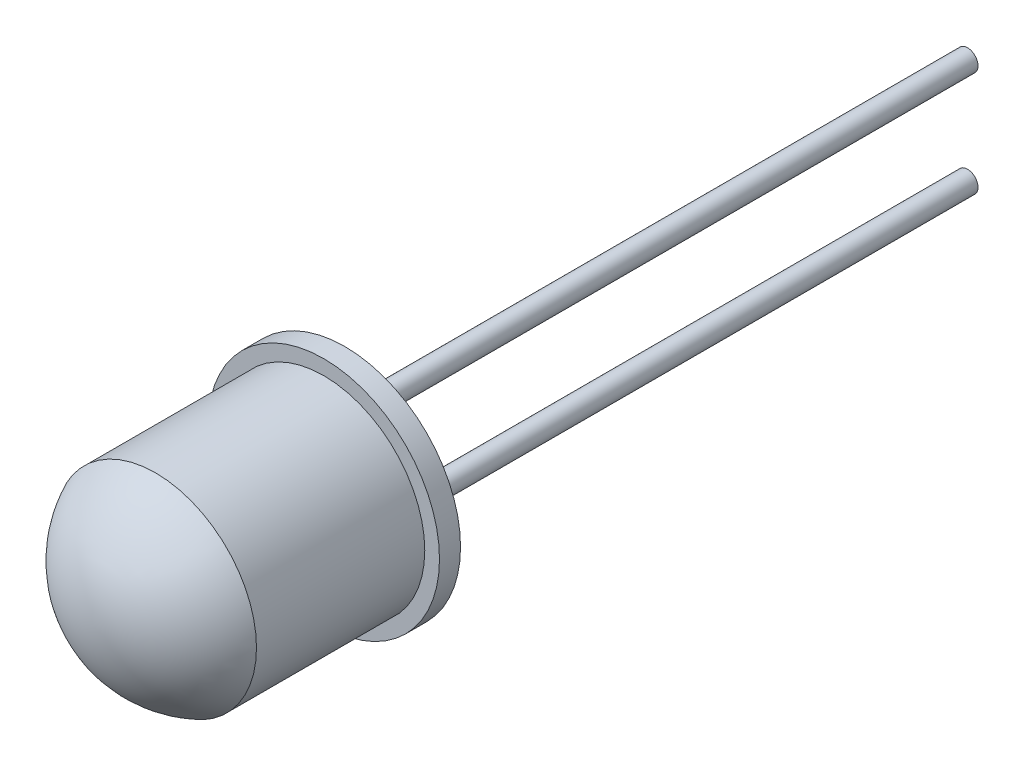
ISO-10303-21;
HEADER;
FILE_DESCRIPTION(('STEP AP214'),'2;1');
FILE_NAME('part.step','',(''),(''),'','','');
FILE_SCHEMA(('AUTOMOTIVE_DESIGN { 1 0 10303 214 1 1 1 1 }'));
ENDSEC;
DATA;
#1=APPLICATION_CONTEXT('core data for automotive mechanical design processes');
#2=APPLICATION_PROTOCOL_DEFINITION('international standard','automotive_design',2000,#1);
#3=PRODUCT_CONTEXT('',#1,'mechanical');
#4=PRODUCT('Part','Part','',(#3));
#5=PRODUCT_RELATED_PRODUCT_CATEGORY('part','',(#4));
#6=PRODUCT_DEFINITION_FORMATION('','',#4);
#7=PRODUCT_DEFINITION_CONTEXT('part definition',#1,'design');
#8=PRODUCT_DEFINITION('design','',#6,#7);
#9=PRODUCT_DEFINITION_SHAPE('','',#8);
#10=(LENGTH_UNIT() NAMED_UNIT(*) SI_UNIT(.MILLI.,.METRE.));
#11=(NAMED_UNIT(*) PLANE_ANGLE_UNIT() SI_UNIT($,.RADIAN.));
#12=(NAMED_UNIT(*) SI_UNIT($,.STERADIAN.) SOLID_ANGLE_UNIT());
#13=UNCERTAINTY_MEASURE_WITH_UNIT(LENGTH_MEASURE(1.E-05),#10,'distance_accuracy_value','');
#14=(GEOMETRIC_REPRESENTATION_CONTEXT(3) GLOBAL_UNCERTAINTY_ASSIGNED_CONTEXT((#13)) GLOBAL_UNIT_ASSIGNED_CONTEXT((#10,
#11,#12)) REPRESENTATION_CONTEXT('',''));
#15=CARTESIAN_POINT('',(0.,0.,0.));
#16=DIRECTION('',(0.,0.,1.));
#17=DIRECTION('',(1.,0.,0.));
#18=AXIS2_PLACEMENT_3D('',#15,#16,#17);
#19=CARTESIAN_POINT('',(0.,0.,0.2));
#20=DIRECTION('',(0.,0.,-1.));
#21=DIRECTION('',(-1.,0.,0.));
#22=AXIS2_PLACEMENT_3D('',#19,#20,#21);
#23=PLANE('',#22);
#24=CARTESIAN_POINT('',(-1.25,0.,0.2));
#25=DIRECTION('',(0.,0.,-1.));
#26=DIRECTION('',(-1.,0.,0.));
#27=AXIS2_PLACEMENT_3D('',#24,#25,#26);
#28=CIRCLE('',#27,0.25);
#29=CARTESIAN_POINT('',(-1.5,0.,0.2));
#30=VERTEX_POINT('',#29);
#31=EDGE_CURVE('E63',#30,#30,#28,.T.);
#32=ORIENTED_EDGE('',*,*,#31,.F.);
#33=EDGE_LOOP('',(#32));
#34=FACE_BOUND('',#33,.T.);
#35=CARTESIAN_POINT('',(0.,0.,0.2));
#36=DIRECTION('',(0.,0.,-1.));
#37=DIRECTION('',(-1.,0.,0.));
#38=AXIS2_PLACEMENT_3D('',#35,#36,#37);
#39=CIRCLE('',#38,2.4);
#40=CARTESIAN_POINT('',(-2.4,0.,0.2));
#41=VERTEX_POINT('',#40);
#42=EDGE_CURVE('E50',#41,#41,#39,.T.);
#43=ORIENTED_EDGE('',*,*,#42,.T.);
#44=EDGE_LOOP('',(#43));
#45=FACE_BOUND('',#44,.T.);
#46=CARTESIAN_POINT('',(0.,1.25,0.2));
#47=DIRECTION('',(0.,0.,-1.));
#48=DIRECTION('',(-1.,0.,0.));
#49=AXIS2_PLACEMENT_3D('',#46,#47,#48);
#50=CIRCLE('',#49,0.25);
#51=CARTESIAN_POINT('',(-0.25,1.25,0.2));
#52=VERTEX_POINT('',#51);
#53=EDGE_CURVE('E57',#52,#52,#50,.T.);
#54=ORIENTED_EDGE('',*,*,#53,.F.);
#55=EDGE_LOOP('',(#54));
#56=FACE_BOUND('',#55,.T.);
#57=CARTESIAN_POINT('',(0.,-1.25,0.2));
#58=DIRECTION('',(0.,0.,-1.));
#59=DIRECTION('',(-1.,0.,0.));
#60=AXIS2_PLACEMENT_3D('',#57,#58,#59);
#61=CIRCLE('',#60,0.25);
#62=CARTESIAN_POINT('',(-0.25,-1.25,0.2));
#63=VERTEX_POINT('',#62);
#64=EDGE_CURVE('E69',#63,#63,#61,.T.);
#65=ORIENTED_EDGE('',*,*,#64,.F.);
#66=EDGE_LOOP('',(#65));
#67=FACE_BOUND('',#66,.T.);
#68=ADVANCED_FACE('F33',(#34,#45,#56,#67),#23,.T.);
#69=CARTESIAN_POINT('',(0.,0.,0.5));
#70=DIRECTION('',(0.,0.,1.));
#71=DIRECTION('',(1.,0.,0.));
#72=AXIS2_PLACEMENT_3D('',#69,#70,#71);
#73=PLANE('',#72);
#74=CARTESIAN_POINT('',(0.,0.,0.5));
#75=DIRECTION('',(0.,0.,1.));
#76=DIRECTION('',(1.,0.,0.));
#77=AXIS2_PLACEMENT_3D('',#74,#75,#76);
#78=CIRCLE('',#77,2.75);
#79=CARTESIAN_POINT('',(2.75,0.,0.5));
#80=VERTEX_POINT('',#79);
#81=EDGE_CURVE('E10',#80,#80,#78,.T.);
#82=ORIENTED_EDGE('',*,*,#81,.T.);
#83=EDGE_LOOP('',(#82));
#84=FACE_BOUND('',#83,.T.);
#85=CARTESIAN_POINT('',(0.,0.,0.5));
#86=DIRECTION('',(0.,0.,1.));
#87=DIRECTION('',(1.,0.,0.));
#88=AXIS2_PLACEMENT_3D('',#85,#86,#87);
#89=CIRCLE('',#88,2.4);
#90=CARTESIAN_POINT('',(2.4,0.,0.5));
#91=VERTEX_POINT('',#90);
#92=EDGE_CURVE('E47',#91,#91,#89,.T.);
#93=ORIENTED_EDGE('',*,*,#92,.F.);
#94=EDGE_LOOP('',(#93));
#95=FACE_BOUND('',#94,.T.);
#96=ADVANCED_FACE('F85',(#84,#95),#73,.T.);
#97=CARTESIAN_POINT('',(0.,0.,0.5));
#98=DIRECTION('',(0.,0.,-1.));
#99=DIRECTION('',(-1.,0.,0.));
#100=AXIS2_PLACEMENT_3D('',#97,#98,#99);
#101=CYLINDRICAL_SURFACE('',#100,2.75);
#102=ORIENTED_EDGE('',*,*,#81,.F.);
#103=EDGE_LOOP('',(#102));
#104=FACE_BOUND('',#103,.T.);
#105=CARTESIAN_POINT('',(0.,0.,0.));
#106=DIRECTION('',(0.,0.,1.));
#107=DIRECTION('',(1.,0.,0.));
#108=AXIS2_PLACEMENT_3D('',#105,#106,#107);
#109=CIRCLE('',#108,2.75);
#110=CARTESIAN_POINT('',(2.75,0.,0.));
#111=VERTEX_POINT('',#110);
#112=EDGE_CURVE('E41',#111,#111,#109,.T.);
#113=ORIENTED_EDGE('',*,*,#112,.T.);
#114=EDGE_LOOP('',(#113));
#115=FACE_BOUND('',#114,.T.);
#116=ADVANCED_FACE('F91',(#104,#115),#101,.T.);
#117=CARTESIAN_POINT('',(0.,0.,0.));
#118=DIRECTION('',(0.,0.,1.));
#119=DIRECTION('',(1.,0.,0.));
#120=AXIS2_PLACEMENT_3D('',#117,#118,#119);
#121=PLANE('',#120);
#122=CARTESIAN_POINT('',(0.,0.,0.));
#123=DIRECTION('',(0.,0.,-1.));
#124=DIRECTION('',(-1.,0.,0.));
#125=AXIS2_PLACEMENT_3D('',#122,#123,#124);
#126=CIRCLE('',#125,2.4);
#127=CARTESIAN_POINT('',(-2.4,0.,0.));
#128=VERTEX_POINT('',#127);
#129=EDGE_CURVE('E51',#128,#128,#126,.T.);
#130=ORIENTED_EDGE('',*,*,#129,.F.);
#131=EDGE_LOOP('',(#130));
#132=FACE_BOUND('',#131,.T.);
#133=ORIENTED_EDGE('',*,*,#112,.F.);
#134=EDGE_LOOP('',(#133));
#135=FACE_BOUND('',#134,.T.);
#136=ADVANCED_FACE('F105',(#132,#135),#121,.F.);
#137=CARTESIAN_POINT('',(0.,0.,4.5));
#138=DIRECTION('',(0.,0.,-1.));
#139=DIRECTION('',(-1.,0.,0.));
#140=AXIS2_PLACEMENT_3D('',#137,#138,#139);
#141=CYLINDRICAL_SURFACE('',#140,2.4);
#142=CARTESIAN_POINT('',(0.,0.,4.5));
#143=DIRECTION('',(0.,0.,1.));
#144=DIRECTION('',(1.,0.,0.));
#145=AXIS2_PLACEMENT_3D('',#142,#143,#144);
#146=CIRCLE('',#145,2.4);
#147=CARTESIAN_POINT('',(2.4,0.,4.5));
#148=VERTEX_POINT('',#147);
#149=EDGE_CURVE('E37',#148,#148,#146,.T.);
#150=ORIENTED_EDGE('',*,*,#149,.F.);
#151=EDGE_LOOP('',(#150));
#152=FACE_BOUND('',#151,.T.);
#153=ORIENTED_EDGE('',*,*,#92,.T.);
#154=EDGE_LOOP('',(#153));
#155=FACE_BOUND('',#154,.T.);
#156=ADVANCED_FACE('F103',(#152,#155),#141,.T.);
#157=CARTESIAN_POINT('',(0.,0.,3.33));
#158=DIRECTION('',(0.,0.,1.));
#159=DIRECTION('',(1.,0.,0.));
#160=AXIS2_PLACEMENT_3D('',#157,#158,#159);
#161=SPHERICAL_SURFACE('',#160,2.67);
#162=ORIENTED_EDGE('',*,*,#149,.T.);
#163=EDGE_LOOP('',(#162));
#164=FACE_BOUND('',#163,.T.);
#165=ADVANCED_FACE('F35',(#164),#161,.T.);
#166=CARTESIAN_POINT('',(0.,0.,0.2));
#167=DIRECTION('',(0.,0.,-1.));
#168=DIRECTION('',(-1.,0.,0.));
#169=AXIS2_PLACEMENT_3D('',#166,#167,#168);
#170=CYLINDRICAL_SURFACE('',#169,2.4);
#171=ORIENTED_EDGE('',*,*,#42,.F.);
#172=EDGE_LOOP('',(#171));
#173=FACE_BOUND('',#172,.T.);
#174=ORIENTED_EDGE('',*,*,#129,.T.);
#175=EDGE_LOOP('',(#174));
#176=FACE_BOUND('',#175,.T.);
#177=ADVANCED_FACE('F99',(#173,#176),#170,.F.);
#178=CARTESIAN_POINT('',(0.,1.25,-14.8));
#179=DIRECTION('',(0.,0.,1.));
#180=DIRECTION('',(1.,0.,0.));
#181=AXIS2_PLACEMENT_3D('',#178,#179,#180);
#182=CYLINDRICAL_SURFACE('',#181,0.25);
#183=CARTESIAN_POINT('',(0.,1.25,-14.8));
#184=DIRECTION('',(0.,0.,-1.));
#185=DIRECTION('',(-1.,0.,0.));
#186=AXIS2_PLACEMENT_3D('',#183,#184,#185);
#187=CIRCLE('',#186,0.25);
#188=CARTESIAN_POINT('',(-0.25,1.25,-14.8));
#189=VERTEX_POINT('',#188);
#190=EDGE_CURVE('E54',#189,#189,#187,.T.);
#191=ORIENTED_EDGE('',*,*,#190,.F.);
#192=EDGE_LOOP('',(#191));
#193=FACE_BOUND('',#192,.T.);
#194=ORIENTED_EDGE('',*,*,#53,.T.);
#195=EDGE_LOOP('',(#194));
#196=FACE_BOUND('',#195,.T.);
#197=ADVANCED_FACE('F97',(#193,#196),#182,.T.);
#198=CARTESIAN_POINT('',(0.,1.25,-14.8));
#199=DIRECTION('',(0.,0.,-1.));
#200=DIRECTION('',(-1.,0.,0.));
#201=AXIS2_PLACEMENT_3D('',#198,#199,#200);
#202=PLANE('',#201);
#203=ORIENTED_EDGE('',*,*,#190,.T.);
#204=EDGE_LOOP('',(#203));
#205=FACE_BOUND('',#204,.T.);
#206=ADVANCED_FACE('F143',(#205),#202,.T.);
#207=CARTESIAN_POINT('',(-1.25,0.,-14.8));
#208=DIRECTION('',(0.,0.,1.));
#209=DIRECTION('',(1.,0.,0.));
#210=AXIS2_PLACEMENT_3D('',#207,#208,#209);
#211=CYLINDRICAL_SURFACE('',#210,0.25);
#212=CARTESIAN_POINT('',(-1.25,0.,-14.8));
#213=DIRECTION('',(0.,0.,-1.));
#214=DIRECTION('',(-1.,0.,0.));
#215=AXIS2_PLACEMENT_3D('',#212,#213,#214);
#216=CIRCLE('',#215,0.25);
#217=CARTESIAN_POINT('',(-1.5,0.,-14.8));
#218=VERTEX_POINT('',#217);
#219=EDGE_CURVE('E60',#218,#218,#216,.T.);
#220=ORIENTED_EDGE('',*,*,#219,.F.);
#221=EDGE_LOOP('',(#220));
#222=FACE_BOUND('',#221,.T.);
#223=ORIENTED_EDGE('',*,*,#31,.T.);
#224=EDGE_LOOP('',(#223));
#225=FACE_BOUND('',#224,.T.);
#226=ADVANCED_FACE('F151',(#222,#225),#211,.T.);
#227=CARTESIAN_POINT('',(-1.25,0.,-14.8));
#228=DIRECTION('',(0.,0.,-1.));
#229=DIRECTION('',(-1.,0.,0.));
#230=AXIS2_PLACEMENT_3D('',#227,#228,#229);
#231=PLANE('',#230);
#232=ORIENTED_EDGE('',*,*,#219,.T.);
#233=EDGE_LOOP('',(#232));
#234=FACE_BOUND('',#233,.T.);
#235=ADVANCED_FACE('F80',(#234),#231,.T.);
#236=CARTESIAN_POINT('',(0.,-1.25,-14.8));
#237=DIRECTION('',(0.,0.,1.));
#238=DIRECTION('',(1.,0.,0.));
#239=AXIS2_PLACEMENT_3D('',#236,#237,#238);
#240=CYLINDRICAL_SURFACE('',#239,0.25);
#241=CARTESIAN_POINT('',(0.,-1.25,-14.8));
#242=DIRECTION('',(0.,0.,-1.));
#243=DIRECTION('',(-1.,0.,0.));
#244=AXIS2_PLACEMENT_3D('',#241,#242,#243);
#245=CIRCLE('',#244,0.25);
#246=CARTESIAN_POINT('',(-0.25,-1.25,-14.8));
#247=VERTEX_POINT('',#246);
#248=EDGE_CURVE('E66',#247,#247,#245,.T.);
#249=ORIENTED_EDGE('',*,*,#248,.F.);
#250=EDGE_LOOP('',(#249));
#251=FACE_BOUND('',#250,.T.);
#252=ORIENTED_EDGE('',*,*,#64,.T.);
#253=EDGE_LOOP('',(#252));
#254=FACE_BOUND('',#253,.T.);
#255=ADVANCED_FACE('F77',(#251,#254),#240,.T.);
#256=CARTESIAN_POINT('',(0.,-1.25,-14.8));
#257=DIRECTION('',(0.,0.,-1.));
#258=DIRECTION('',(-1.,0.,0.));
#259=AXIS2_PLACEMENT_3D('',#256,#257,#258);
#260=PLANE('',#259);
#261=ORIENTED_EDGE('',*,*,#248,.T.);
#262=EDGE_LOOP('',(#261));
#263=FACE_BOUND('',#262,.T.);
#264=ADVANCED_FACE('F75',(#263),#260,.T.);
#265=CLOSED_SHELL('',(#68,#96,#116,#136,#156,#165,#177,#197,#206,#226,#235,#255,#264));
#266=MANIFOLD_SOLID_BREP('B2',#265);
#267=ADVANCED_BREP_SHAPE_REPRESENTATION('',(#18,#266),#14);
#268=SHAPE_DEFINITION_REPRESENTATION(#9,#267);
ENDSEC;
END-ISO-10303-21;
